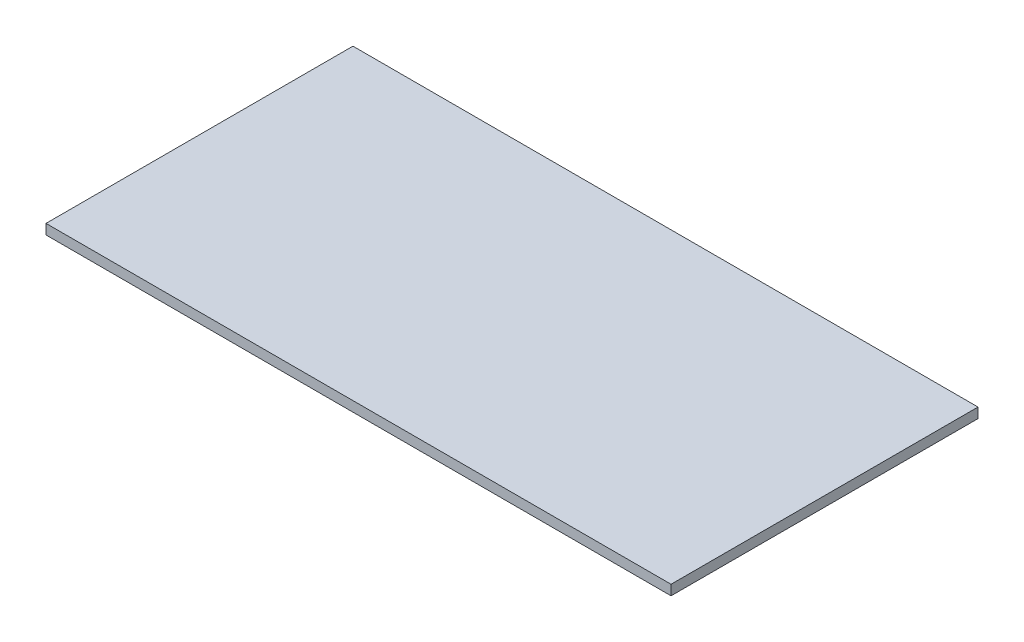
ISO-10303-21;
HEADER;
FILE_DESCRIPTION(('STEP AP214'),'2;1');
FILE_NAME('part.step','',(''),(''),'','','');
FILE_SCHEMA(('AUTOMOTIVE_DESIGN { 1 0 10303 214 1 1 1 1 }'));
ENDSEC;
DATA;
#1=APPLICATION_CONTEXT('core data for automotive mechanical design processes');
#2=APPLICATION_PROTOCOL_DEFINITION('international standard','automotive_design',2000,#1);
#3=PRODUCT_CONTEXT('',#1,'mechanical');
#4=PRODUCT('Part','Part','',(#3));
#5=PRODUCT_RELATED_PRODUCT_CATEGORY('part','',(#4));
#6=PRODUCT_DEFINITION_FORMATION('','',#4);
#7=PRODUCT_DEFINITION_CONTEXT('part definition',#1,'design');
#8=PRODUCT_DEFINITION('design','',#6,#7);
#9=PRODUCT_DEFINITION_SHAPE('','',#8);
#10=(LENGTH_UNIT() NAMED_UNIT(*) SI_UNIT(.MILLI.,.METRE.));
#11=(NAMED_UNIT(*) PLANE_ANGLE_UNIT() SI_UNIT($,.RADIAN.));
#12=(NAMED_UNIT(*) SI_UNIT($,.STERADIAN.) SOLID_ANGLE_UNIT());
#13=UNCERTAINTY_MEASURE_WITH_UNIT(LENGTH_MEASURE(1.E-05),#10,'distance_accuracy_value','');
#14=(GEOMETRIC_REPRESENTATION_CONTEXT(3) GLOBAL_UNCERTAINTY_ASSIGNED_CONTEXT((#13)) GLOBAL_UNIT_ASSIGNED_CONTEXT((#10,
#11,#12)) REPRESENTATION_CONTEXT('',''));
#15=CARTESIAN_POINT('',(0.,0.,0.));
#16=DIRECTION('',(0.,0.,1.));
#17=DIRECTION('',(1.,0.,0.));
#18=AXIS2_PLACEMENT_3D('',#15,#16,#17);
#19=CARTESIAN_POINT('',(-560.,18.,275.));
#20=DIRECTION('',(1.,0.,0.));
#21=DIRECTION('',(0.,0.,-1.));
#22=AXIS2_PLACEMENT_3D('',#19,#20,#21);
#23=PLANE('',#22);
#24=DIRECTION('',(0.,0.,1.));
#25=VECTOR('',#24,1.);
#26=CARTESIAN_POINT('',(-560.,0.,275.));
#27=LINE('',#26,#25);
#28=CARTESIAN_POINT('',(-560.,0.,-275.));
#29=VERTEX_POINT('',#28);
#30=CARTESIAN_POINT('',(-560.,0.,275.));
#31=VERTEX_POINT('',#30);
#32=EDGE_CURVE('E98',#29,#31,#27,.T.);
#33=ORIENTED_EDGE('',*,*,#32,.T.);
#34=DIRECTION('',(0.,-1.,0.));
#35=VECTOR('',#34,1.);
#36=CARTESIAN_POINT('',(-560.,18.,275.));
#37=LINE('',#36,#35);
#38=CARTESIAN_POINT('',(-560.,18.,275.));
#39=VERTEX_POINT('',#38);
#40=EDGE_CURVE('E11',#39,#31,#37,.T.);
#41=ORIENTED_EDGE('',*,*,#40,.F.);
#42=DIRECTION('',(0.,0.,1.));
#43=VECTOR('',#42,1.);
#44=CARTESIAN_POINT('',(-560.,18.,275.));
#45=LINE('',#44,#43);
#46=CARTESIAN_POINT('',(-560.,18.,-275.));
#47=VERTEX_POINT('',#46);
#48=EDGE_CURVE('E86',#47,#39,#45,.T.);
#49=ORIENTED_EDGE('',*,*,#48,.F.);
#50=DIRECTION('',(0.,-1.,0.));
#51=VECTOR('',#50,1.);
#52=CARTESIAN_POINT('',(-560.,18.,-275.));
#53=LINE('',#52,#51);
#54=EDGE_CURVE('E94',#47,#29,#53,.T.);
#55=ORIENTED_EDGE('',*,*,#54,.T.);
#56=EDGE_LOOP('',(#33,#41,#49,#55));
#57=FACE_BOUND('',#56,.T.);
#58=ADVANCED_FACE('F35',(#57),#23,.F.);
#59=CARTESIAN_POINT('',(560.,18.,275.));
#60=DIRECTION('',(0.,0.,-1.));
#61=DIRECTION('',(-1.,0.,0.));
#62=AXIS2_PLACEMENT_3D('',#59,#60,#61);
#63=PLANE('',#62);
#64=DIRECTION('',(1.,0.,0.));
#65=VECTOR('',#64,1.);
#66=CARTESIAN_POINT('',(560.,0.,275.));
#67=LINE('',#66,#65);
#68=CARTESIAN_POINT('',(560.,0.,275.));
#69=VERTEX_POINT('',#68);
#70=EDGE_CURVE('E90',#31,#69,#67,.T.);
#71=ORIENTED_EDGE('',*,*,#70,.T.);
#72=DIRECTION('',(0.,-1.,0.));
#73=VECTOR('',#72,1.);
#74=CARTESIAN_POINT('',(560.,18.,275.));
#75=LINE('',#74,#73);
#76=CARTESIAN_POINT('',(560.,18.,275.));
#77=VERTEX_POINT('',#76);
#78=EDGE_CURVE('E43',#77,#69,#75,.T.);
#79=ORIENTED_EDGE('',*,*,#78,.F.);
#80=DIRECTION('',(1.,0.,0.));
#81=VECTOR('',#80,1.);
#82=CARTESIAN_POINT('',(560.,18.,275.));
#83=LINE('',#82,#81);
#84=EDGE_CURVE('E81',#39,#77,#83,.T.);
#85=ORIENTED_EDGE('',*,*,#84,.F.);
#86=ORIENTED_EDGE('',*,*,#40,.T.);
#87=EDGE_LOOP('',(#71,#79,#85,#86));
#88=FACE_BOUND('',#87,.T.);
#89=ADVANCED_FACE('F89',(#88),#63,.F.);
#90=CARTESIAN_POINT('',(560.,18.,275.));
#91=DIRECTION('',(-1.,0.,0.));
#92=DIRECTION('',(0.,0.,1.));
#93=AXIS2_PLACEMENT_3D('',#90,#91,#92);
#94=PLANE('',#93);
#95=DIRECTION('',(0.,0.,-1.));
#96=VECTOR('',#95,1.);
#97=CARTESIAN_POINT('',(560.,0.,275.));
#98=LINE('',#97,#96);
#99=CARTESIAN_POINT('',(560.,0.,-275.));
#100=VERTEX_POINT('',#99);
#101=EDGE_CURVE('E68',#69,#100,#98,.T.);
#102=ORIENTED_EDGE('',*,*,#101,.T.);
#103=DIRECTION('',(0.,-1.,0.));
#104=VECTOR('',#103,1.);
#105=CARTESIAN_POINT('',(560.,18.,-275.));
#106=LINE('',#105,#104);
#107=CARTESIAN_POINT('',(560.,18.,-275.));
#108=VERTEX_POINT('',#107);
#109=EDGE_CURVE('E91',#108,#100,#106,.T.);
#110=ORIENTED_EDGE('',*,*,#109,.F.);
#111=DIRECTION('',(0.,0.,-1.));
#112=VECTOR('',#111,1.);
#113=CARTESIAN_POINT('',(560.,18.,275.));
#114=LINE('',#113,#112);
#115=EDGE_CURVE('E84',#77,#108,#114,.T.);
#116=ORIENTED_EDGE('',*,*,#115,.F.);
#117=ORIENTED_EDGE('',*,*,#78,.T.);
#118=EDGE_LOOP('',(#102,#110,#116,#117));
#119=FACE_BOUND('',#118,.T.);
#120=ADVANCED_FACE('F92',(#119),#94,.F.);
#121=CARTESIAN_POINT('',(560.,18.,-275.));
#122=DIRECTION('',(0.,0.,1.));
#123=DIRECTION('',(1.,0.,0.));
#124=AXIS2_PLACEMENT_3D('',#121,#122,#123);
#125=PLANE('',#124);
#126=DIRECTION('',(-1.,0.,0.));
#127=VECTOR('',#126,1.);
#128=CARTESIAN_POINT('',(560.,0.,-275.));
#129=LINE('',#128,#127);
#130=EDGE_CURVE('E74',#100,#29,#129,.T.);
#131=ORIENTED_EDGE('',*,*,#130,.T.);
#132=ORIENTED_EDGE('',*,*,#54,.F.);
#133=DIRECTION('',(-1.,0.,0.));
#134=VECTOR('',#133,1.);
#135=CARTESIAN_POINT('',(560.,18.,-275.));
#136=LINE('',#135,#134);
#137=EDGE_CURVE('E51',#108,#47,#136,.T.);
#138=ORIENTED_EDGE('',*,*,#137,.F.);
#139=ORIENTED_EDGE('',*,*,#109,.T.);
#140=EDGE_LOOP('',(#131,#132,#138,#139));
#141=FACE_BOUND('',#140,.T.);
#142=ADVANCED_FACE('F105',(#141),#125,.F.);
#143=CARTESIAN_POINT('',(0.,18.,0.));
#144=DIRECTION('',(0.,1.,0.));
#145=DIRECTION('',(0.,0.,1.));
#146=AXIS2_PLACEMENT_3D('',#143,#144,#145);
#147=PLANE('',#146);
#148=ORIENTED_EDGE('',*,*,#48,.T.);
#149=ORIENTED_EDGE('',*,*,#84,.T.);
#150=ORIENTED_EDGE('',*,*,#115,.T.);
#151=ORIENTED_EDGE('',*,*,#137,.T.);
#152=EDGE_LOOP('',(#148,#149,#150,#151));
#153=FACE_BOUND('',#152,.T.);
#154=ADVANCED_FACE('F82',(#153),#147,.T.);
#155=CARTESIAN_POINT('',(0.,0.,0.));
#156=DIRECTION('',(0.,1.,0.));
#157=DIRECTION('',(0.,0.,1.));
#158=AXIS2_PLACEMENT_3D('',#155,#156,#157);
#159=PLANE('',#158);
#160=ORIENTED_EDGE('',*,*,#32,.F.);
#161=ORIENTED_EDGE('',*,*,#130,.F.);
#162=ORIENTED_EDGE('',*,*,#101,.F.);
#163=ORIENTED_EDGE('',*,*,#70,.F.);
#164=EDGE_LOOP('',(#160,#161,#162,#163));
#165=FACE_BOUND('',#164,.T.);
#166=ADVANCED_FACE('F108',(#165),#159,.F.);
#167=CLOSED_SHELL('',(#58,#89,#120,#142,#154,#166));
#168=MANIFOLD_SOLID_BREP('B2',#167);
#169=ADVANCED_BREP_SHAPE_REPRESENTATION('',(#18,#168),#14);
#170=SHAPE_DEFINITION_REPRESENTATION(#9,#169);
ENDSEC;
END-ISO-10303-21;
